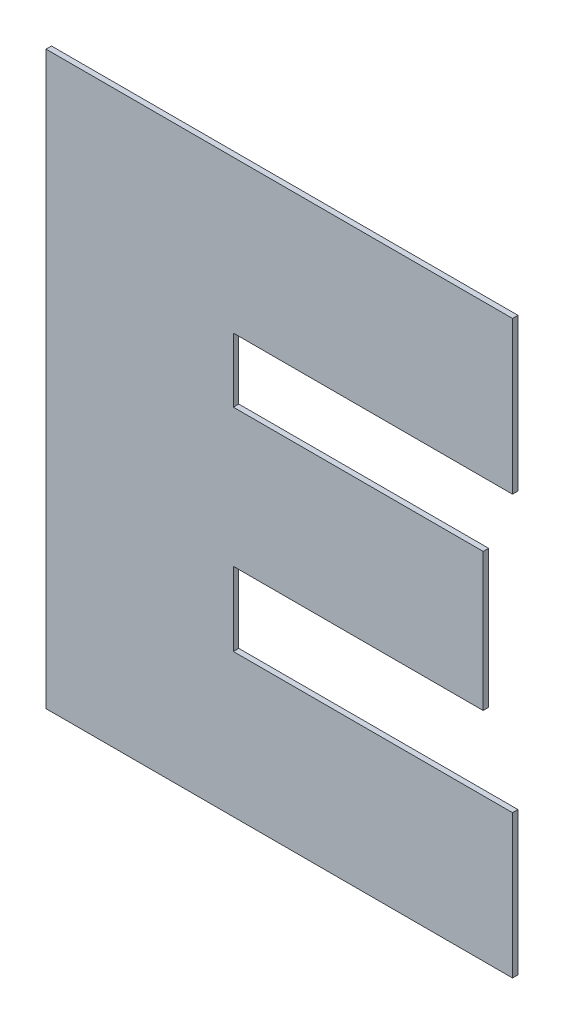
ISO-10303-21;
HEADER;
FILE_DESCRIPTION(('STEP AP214'),'2;1');
FILE_NAME('part.step','',(''),(''),'','','');
FILE_SCHEMA(('AUTOMOTIVE_DESIGN { 1 0 10303 214 1 1 1 1 }'));
ENDSEC;
DATA;
#1=APPLICATION_CONTEXT('core data for automotive mechanical design processes');
#2=APPLICATION_PROTOCOL_DEFINITION('international standard','automotive_design',2000,#1);
#3=PRODUCT_CONTEXT('',#1,'mechanical');
#4=PRODUCT('Part','Part','',(#3));
#5=PRODUCT_RELATED_PRODUCT_CATEGORY('part','',(#4));
#6=PRODUCT_DEFINITION_FORMATION('','',#4);
#7=PRODUCT_DEFINITION_CONTEXT('part definition',#1,'design');
#8=PRODUCT_DEFINITION('design','',#6,#7);
#9=PRODUCT_DEFINITION_SHAPE('','',#8);
#10=(LENGTH_UNIT() NAMED_UNIT(*) SI_UNIT(.MILLI.,.METRE.));
#11=(NAMED_UNIT(*) PLANE_ANGLE_UNIT() SI_UNIT($,.RADIAN.));
#12=(NAMED_UNIT(*) SI_UNIT($,.STERADIAN.) SOLID_ANGLE_UNIT());
#13=UNCERTAINTY_MEASURE_WITH_UNIT(LENGTH_MEASURE(1.E-05),#10,'distance_accuracy_value','');
#14=(GEOMETRIC_REPRESENTATION_CONTEXT(3) GLOBAL_UNCERTAINTY_ASSIGNED_CONTEXT((#13)) GLOBAL_UNIT_ASSIGNED_CONTEXT((#10,
#11,#12)) REPRESENTATION_CONTEXT('',''));
#15=CARTESIAN_POINT('',(0.,0.,0.));
#16=DIRECTION('',(0.,0.,1.));
#17=DIRECTION('',(1.,0.,0.));
#18=AXIS2_PLACEMENT_3D('',#15,#16,#17);
#19=CARTESIAN_POINT('',(0.,1.11494944132031,0.551));
#20=DIRECTION('',(0.,1.,0.));
#21=DIRECTION('',(0.,0.,1.));
#22=AXIS2_PLACEMENT_3D('',#19,#20,#21);
#23=PLANE('',#22);
#24=DIRECTION('',(1.,0.,0.));
#25=VECTOR('',#24,1.);
#26=CARTESIAN_POINT('',(1.26536255211483,1.11494944132031,0.55));
#27=LINE('',#26,#25);
#28=CARTESIAN_POINT('',(1.26536255211483,1.11494944132031,0.55));
#29=VERTEX_POINT('',#28);
#30=CARTESIAN_POINT('',(1.31671644638677,1.11494944132031,0.55));
#31=VERTEX_POINT('',#30);
#32=EDGE_CURVE('E11',#29,#31,#27,.T.);
#33=ORIENTED_EDGE('',*,*,#32,.T.);
#34=DIRECTION('',(0.,-2.22044604925006E-13,-1.));
#35=VECTOR('',#34,1.);
#36=CARTESIAN_POINT('',(1.31671644638677,1.11494944132031,0.551));
#37=LINE('',#36,#35);
#38=CARTESIAN_POINT('',(1.31671644638677,1.11494944132031,0.551));
#39=VERTEX_POINT('',#38);
#40=EDGE_CURVE('E200',#39,#31,#37,.T.);
#41=ORIENTED_EDGE('',*,*,#40,.F.);
#42=DIRECTION('',(1.,0.,0.));
#43=VECTOR('',#42,1.);
#44=CARTESIAN_POINT('',(1.26536255211483,1.11494944132031,0.551));
#45=LINE('',#44,#43);
#46=CARTESIAN_POINT('',(1.26536255211483,1.11494944132031,0.551));
#47=VERTEX_POINT('',#46);
#48=EDGE_CURVE('E194',#47,#39,#45,.T.);
#49=ORIENTED_EDGE('',*,*,#48,.F.);
#50=DIRECTION('',(0.,-2.22044604925006E-13,-1.));
#51=VECTOR('',#50,1.);
#52=CARTESIAN_POINT('',(1.26536255211483,1.11494944132031,0.551));
#53=LINE('',#52,#51);
#54=EDGE_CURVE('E121',#47,#29,#53,.T.);
#55=ORIENTED_EDGE('',*,*,#54,.T.);
#56=EDGE_LOOP('',(#33,#41,#49,#55));
#57=FACE_BOUND('',#56,.T.);
#58=ADVANCED_FACE('F17',(#57),#23,.F.);
#59=CARTESIAN_POINT('',(1.31671644638677,0.,0.551));
#60=DIRECTION('',(-1.,0.,0.));
#61=DIRECTION('',(0.,0.,1.));
#62=AXIS2_PLACEMENT_3D('',#59,#60,#61);
#63=PLANE('',#62);
#64=DIRECTION('',(0.,1.,0.));
#65=VECTOR('',#64,1.);
#66=CARTESIAN_POINT('',(1.31671644638677,1.11494944132031,0.55));
#67=LINE('',#66,#65);
#68=CARTESIAN_POINT('',(1.31671644638677,1.14295195682548,0.55));
#69=VERTEX_POINT('',#68);
#70=EDGE_CURVE('E24',#31,#69,#67,.T.);
#71=ORIENTED_EDGE('',*,*,#70,.T.);
#72=DIRECTION('',(0.,0.,-1.));
#73=VECTOR('',#72,1.);
#74=CARTESIAN_POINT('',(1.31671644638677,1.14295195682548,0.551));
#75=LINE('',#74,#73);
#76=CARTESIAN_POINT('',(1.31671644638677,1.14295195682548,0.551));
#77=VERTEX_POINT('',#76);
#78=EDGE_CURVE('E196',#77,#69,#75,.T.);
#79=ORIENTED_EDGE('',*,*,#78,.F.);
#80=DIRECTION('',(0.,1.,0.));
#81=VECTOR('',#80,1.);
#82=CARTESIAN_POINT('',(1.31671644638677,1.11494944132031,0.551));
#83=LINE('',#82,#81);
#84=EDGE_CURVE('E186',#39,#77,#83,.T.);
#85=ORIENTED_EDGE('',*,*,#84,.F.);
#86=ORIENTED_EDGE('',*,*,#40,.T.);
#87=EDGE_LOOP('',(#71,#79,#85,#86));
#88=FACE_BOUND('',#87,.T.);
#89=ADVANCED_FACE('F202',(#88),#63,.F.);
#90=CARTESIAN_POINT('',(0.,1.14295195682548,0.551));
#91=DIRECTION('',(0.,-1.,0.));
#92=DIRECTION('',(0.,0.,-1.));
#93=AXIS2_PLACEMENT_3D('',#90,#91,#92);
#94=PLANE('',#93);
#95=DIRECTION('',(-1.,0.,0.));
#96=VECTOR('',#95,1.);
#97=CARTESIAN_POINT('',(1.31671644638677,1.14295195682548,0.55));
#98=LINE('',#97,#96);
#99=CARTESIAN_POINT('',(1.23092017763378,1.14295195682548,0.55));
#100=VERTEX_POINT('',#99);
#101=EDGE_CURVE('E198',#69,#100,#98,.T.);
#102=ORIENTED_EDGE('',*,*,#101,.T.);
#103=DIRECTION('',(0.,0.,-1.));
#104=VECTOR('',#103,1.);
#105=CARTESIAN_POINT('',(1.23092017763378,1.14295195682548,0.551));
#106=LINE('',#105,#104);
#107=CARTESIAN_POINT('',(1.23092017763378,1.14295195682548,0.551));
#108=VERTEX_POINT('',#107);
#109=EDGE_CURVE('E189',#108,#100,#106,.T.);
#110=ORIENTED_EDGE('',*,*,#109,.F.);
#111=DIRECTION('',(-1.,0.,0.));
#112=VECTOR('',#111,1.);
#113=CARTESIAN_POINT('',(1.31671644638677,1.14295195682548,0.551));
#114=LINE('',#113,#112);
#115=EDGE_CURVE('E177',#77,#108,#114,.T.);
#116=ORIENTED_EDGE('',*,*,#115,.F.);
#117=ORIENTED_EDGE('',*,*,#78,.T.);
#118=EDGE_LOOP('',(#102,#110,#116,#117));
#119=FACE_BOUND('',#118,.T.);
#120=ADVANCED_FACE('F209',(#119),#94,.F.);
#121=CARTESIAN_POINT('',(1.23092017763378,0.,0.551));
#122=DIRECTION('',(1.,0.,0.));
#123=DIRECTION('',(0.,0.,-1.));
#124=AXIS2_PLACEMENT_3D('',#121,#122,#123);
#125=PLANE('',#124);
#126=DIRECTION('',(0.,-1.,0.));
#127=VECTOR('',#126,1.);
#128=CARTESIAN_POINT('',(1.23092017763378,1.14295195682548,0.55));
#129=LINE('',#128,#127);
#130=CARTESIAN_POINT('',(1.23092017763378,1.03788478321106,0.55));
#131=VERTEX_POINT('',#130);
#132=EDGE_CURVE('E192',#100,#131,#129,.T.);
#133=ORIENTED_EDGE('',*,*,#132,.T.);
#134=DIRECTION('',(0.,0.,-1.));
#135=VECTOR('',#134,1.);
#136=CARTESIAN_POINT('',(1.23092017763378,1.03788478321106,0.551));
#137=LINE('',#136,#135);
#138=CARTESIAN_POINT('',(1.23092017763378,1.03788478321106,0.551));
#139=VERTEX_POINT('',#138);
#140=EDGE_CURVE('E180',#139,#131,#137,.T.);
#141=ORIENTED_EDGE('',*,*,#140,.F.);
#142=DIRECTION('',(0.,-1.,0.));
#143=VECTOR('',#142,1.);
#144=CARTESIAN_POINT('',(1.23092017763378,1.14295195682548,0.551));
#145=LINE('',#144,#143);
#146=EDGE_CURVE('E169',#108,#139,#145,.T.);
#147=ORIENTED_EDGE('',*,*,#146,.F.);
#148=ORIENTED_EDGE('',*,*,#109,.T.);
#149=EDGE_LOOP('',(#133,#141,#147,#148));
#150=FACE_BOUND('',#149,.T.);
#151=ADVANCED_FACE('F213',(#150),#125,.F.);
#152=CARTESIAN_POINT('',(0.,1.03788478321106,0.551));
#153=DIRECTION('',(0.,1.,0.));
#154=DIRECTION('',(0.,0.,1.));
#155=AXIS2_PLACEMENT_3D('',#152,#153,#154);
#156=PLANE('',#155);
#157=DIRECTION('',(1.,0.,0.));
#158=VECTOR('',#157,1.);
#159=CARTESIAN_POINT('',(1.23092017763378,1.03788478321106,0.55));
#160=LINE('',#159,#158);
#161=CARTESIAN_POINT('',(1.31671644638677,1.03788478321106,0.55));
#162=VERTEX_POINT('',#161);
#163=EDGE_CURVE('E183',#131,#162,#160,.T.);
#164=ORIENTED_EDGE('',*,*,#163,.T.);
#165=DIRECTION('',(0.,0.,-1.));
#166=VECTOR('',#165,1.);
#167=CARTESIAN_POINT('',(1.31671644638677,1.03788478321106,0.551));
#168=LINE('',#167,#166);
#169=CARTESIAN_POINT('',(1.31671644638677,1.03788478321106,0.551));
#170=VERTEX_POINT('',#169);
#171=EDGE_CURVE('E172',#170,#162,#168,.T.);
#172=ORIENTED_EDGE('',*,*,#171,.F.);
#173=DIRECTION('',(1.,0.,0.));
#174=VECTOR('',#173,1.);
#175=CARTESIAN_POINT('',(1.23092017763378,1.03788478321106,0.551));
#176=LINE('',#175,#174);
#177=EDGE_CURVE('E161',#139,#170,#176,.T.);
#178=ORIENTED_EDGE('',*,*,#177,.F.);
#179=ORIENTED_EDGE('',*,*,#140,.T.);
#180=EDGE_LOOP('',(#164,#172,#178,#179));
#181=FACE_BOUND('',#180,.T.);
#182=ADVANCED_FACE('F235',(#181),#156,.F.);
#183=CARTESIAN_POINT('',(1.31671644638677,0.,0.551));
#184=DIRECTION('',(-1.,0.,0.));
#185=DIRECTION('',(0.,0.,1.));
#186=AXIS2_PLACEMENT_3D('',#183,#184,#185);
#187=PLANE('',#186);
#188=DIRECTION('',(0.,1.,0.));
#189=VECTOR('',#188,1.);
#190=CARTESIAN_POINT('',(1.31671644638677,1.03788478321106,0.55));
#191=LINE('',#190,#189);
#192=CARTESIAN_POINT('',(1.31671644638677,1.06422085452814,0.55));
#193=VERTEX_POINT('',#192);
#194=EDGE_CURVE('E175',#162,#193,#191,.T.);
#195=ORIENTED_EDGE('',*,*,#194,.T.);
#196=DIRECTION('',(0.,0.,-1.));
#197=VECTOR('',#196,1.);
#198=CARTESIAN_POINT('',(1.31671644638677,1.06422085452814,0.551));
#199=LINE('',#198,#197);
#200=CARTESIAN_POINT('',(1.31671644638677,1.06422085452814,0.551));
#201=VERTEX_POINT('',#200);
#202=EDGE_CURVE('E164',#201,#193,#199,.T.);
#203=ORIENTED_EDGE('',*,*,#202,.F.);
#204=DIRECTION('',(0.,1.,0.));
#205=VECTOR('',#204,1.);
#206=CARTESIAN_POINT('',(1.31671644638677,1.03788478321106,0.551));
#207=LINE('',#206,#205);
#208=EDGE_CURVE('E153',#170,#201,#207,.T.);
#209=ORIENTED_EDGE('',*,*,#208,.F.);
#210=ORIENTED_EDGE('',*,*,#171,.T.);
#211=EDGE_LOOP('',(#195,#203,#209,#210));
#212=FACE_BOUND('',#211,.T.);
#213=ADVANCED_FACE('F233',(#212),#187,.F.);
#214=CARTESIAN_POINT('',(0.,1.06422085452814,0.551));
#215=DIRECTION('',(0.,-1.,0.));
#216=DIRECTION('',(0.,0.,-1.));
#217=AXIS2_PLACEMENT_3D('',#214,#215,#216);
#218=PLANE('',#217);
#219=DIRECTION('',(-1.,0.,0.));
#220=VECTOR('',#219,1.);
#221=CARTESIAN_POINT('',(1.31671644638677,1.06422085452814,0.55));
#222=LINE('',#221,#220);
#223=CARTESIAN_POINT('',(1.26536255211483,1.06422085452814,0.55));
#224=VERTEX_POINT('',#223);
#225=EDGE_CURVE('E167',#193,#224,#222,.T.);
#226=ORIENTED_EDGE('',*,*,#225,.T.);
#227=DIRECTION('',(0.,0.,-1.));
#228=VECTOR('',#227,1.);
#229=CARTESIAN_POINT('',(1.26536255211483,1.06422085452814,0.551));
#230=LINE('',#229,#228);
#231=CARTESIAN_POINT('',(1.26536255211483,1.06422085452814,0.551));
#232=VERTEX_POINT('',#231);
#233=EDGE_CURVE('E156',#232,#224,#230,.T.);
#234=ORIENTED_EDGE('',*,*,#233,.F.);
#235=DIRECTION('',(-1.,0.,0.));
#236=VECTOR('',#235,1.);
#237=CARTESIAN_POINT('',(1.31671644638677,1.06422085452814,0.551));
#238=LINE('',#237,#236);
#239=EDGE_CURVE('E145',#201,#232,#238,.T.);
#240=ORIENTED_EDGE('',*,*,#239,.F.);
#241=ORIENTED_EDGE('',*,*,#202,.T.);
#242=EDGE_LOOP('',(#226,#234,#240,#241));
#243=FACE_BOUND('',#242,.T.);
#244=ADVANCED_FACE('F229',(#243),#218,.F.);
#245=CARTESIAN_POINT('',(1.26536255211483,0.,0.551));
#246=DIRECTION('',(-1.,0.,0.));
#247=DIRECTION('',(0.,0.,1.));
#248=AXIS2_PLACEMENT_3D('',#245,#246,#247);
#249=PLANE('',#248);
#250=DIRECTION('',(0.,1.,0.));
#251=VECTOR('',#250,1.);
#252=CARTESIAN_POINT('',(1.26536255211483,1.06422085452814,0.55));
#253=LINE('',#252,#251);
#254=CARTESIAN_POINT('',(1.26536255211483,1.07779639115823,0.55));
#255=VERTEX_POINT('',#254);
#256=EDGE_CURVE('E159',#224,#255,#253,.T.);
#257=ORIENTED_EDGE('',*,*,#256,.T.);
#258=DIRECTION('',(0.,0.,-1.));
#259=VECTOR('',#258,1.);
#260=CARTESIAN_POINT('',(1.26536255211483,1.07779639115823,0.551));
#261=LINE('',#260,#259);
#262=CARTESIAN_POINT('',(1.26536255211483,1.07779639115823,0.551));
#263=VERTEX_POINT('',#262);
#264=EDGE_CURVE('E148',#263,#255,#261,.T.);
#265=ORIENTED_EDGE('',*,*,#264,.F.);
#266=DIRECTION('',(0.,1.,0.));
#267=VECTOR('',#266,1.);
#268=CARTESIAN_POINT('',(1.26536255211483,1.06422085452814,0.551));
#269=LINE('',#268,#267);
#270=EDGE_CURVE('E137',#232,#263,#269,.T.);
#271=ORIENTED_EDGE('',*,*,#270,.F.);
#272=ORIENTED_EDGE('',*,*,#233,.T.);
#273=EDGE_LOOP('',(#257,#265,#271,#272));
#274=FACE_BOUND('',#273,.T.);
#275=ADVANCED_FACE('F225',(#274),#249,.F.);
#276=CARTESIAN_POINT('',(0.,1.07779639115823,0.551));
#277=DIRECTION('',(0.,1.,0.));
#278=DIRECTION('',(0.,0.,1.));
#279=AXIS2_PLACEMENT_3D('',#276,#277,#278);
#280=PLANE('',#279);
#281=DIRECTION('',(1.,0.,0.));
#282=VECTOR('',#281,1.);
#283=CARTESIAN_POINT('',(1.26536255211483,1.07779639115823,0.55));
#284=LINE('',#283,#282);
#285=CARTESIAN_POINT('',(1.31131976972094,1.07779639115823,0.55));
#286=VERTEX_POINT('',#285);
#287=EDGE_CURVE('E151',#255,#286,#284,.T.);
#288=ORIENTED_EDGE('',*,*,#287,.T.);
#289=DIRECTION('',(0.,0.,-1.));
#290=VECTOR('',#289,1.);
#291=CARTESIAN_POINT('',(1.31131976972094,1.07779639115823,0.551));
#292=LINE('',#291,#290);
#293=CARTESIAN_POINT('',(1.31131976972094,1.07779639115823,0.551));
#294=VERTEX_POINT('',#293);
#295=EDGE_CURVE('E140',#294,#286,#292,.T.);
#296=ORIENTED_EDGE('',*,*,#295,.F.);
#297=DIRECTION('',(1.,0.,0.));
#298=VECTOR('',#297,1.);
#299=CARTESIAN_POINT('',(1.26536255211483,1.07779639115823,0.551));
#300=LINE('',#299,#298);
#301=EDGE_CURVE('E132',#263,#294,#300,.T.);
#302=ORIENTED_EDGE('',*,*,#301,.F.);
#303=ORIENTED_EDGE('',*,*,#264,.T.);
#304=EDGE_LOOP('',(#288,#296,#302,#303));
#305=FACE_BOUND('',#304,.T.);
#306=ADVANCED_FACE('F222',(#305),#280,.F.);
#307=CARTESIAN_POINT('',(1.31131976972094,0.,0.551));
#308=DIRECTION('',(-1.,0.,0.));
#309=DIRECTION('',(0.,0.,1.));
#310=AXIS2_PLACEMENT_3D('',#307,#308,#309);
#311=PLANE('',#310);
#312=DIRECTION('',(0.,1.,0.));
#313=VECTOR('',#312,1.);
#314=CARTESIAN_POINT('',(1.31131976972094,1.07779639115823,0.55));
#315=LINE('',#314,#313);
#316=CARTESIAN_POINT('',(1.31131976972094,1.10314159654861,0.55));
#317=VERTEX_POINT('',#316);
#318=EDGE_CURVE('E143',#286,#317,#315,.T.);
#319=ORIENTED_EDGE('',*,*,#318,.T.);
#320=DIRECTION('',(0.,0.,-1.));
#321=VECTOR('',#320,1.);
#322=CARTESIAN_POINT('',(1.31131976972094,1.10314159654861,0.551));
#323=LINE('',#322,#321);
#324=CARTESIAN_POINT('',(1.31131976972094,1.10314159654861,0.551));
#325=VERTEX_POINT('',#324);
#326=EDGE_CURVE('E134',#325,#317,#323,.T.);
#327=ORIENTED_EDGE('',*,*,#326,.F.);
#328=DIRECTION('',(0.,1.,0.));
#329=VECTOR('',#328,1.);
#330=CARTESIAN_POINT('',(1.31131976972094,1.07779639115823,0.551));
#331=LINE('',#330,#329);
#332=EDGE_CURVE('E115',#294,#325,#331,.T.);
#333=ORIENTED_EDGE('',*,*,#332,.F.);
#334=ORIENTED_EDGE('',*,*,#295,.T.);
#335=EDGE_LOOP('',(#319,#327,#333,#334));
#336=FACE_BOUND('',#335,.T.);
#337=ADVANCED_FACE('F219',(#336),#311,.F.);
#338=CARTESIAN_POINT('',(0.,1.10314159654861,0.551));
#339=DIRECTION('',(0.,-1.,0.));
#340=DIRECTION('',(0.,0.,-1.));
#341=AXIS2_PLACEMENT_3D('',#338,#339,#340);
#342=PLANE('',#341);
#343=DIRECTION('',(-1.,0.,0.));
#344=VECTOR('',#343,1.);
#345=CARTESIAN_POINT('',(1.31131976972094,1.10314159654861,0.55));
#346=LINE('',#345,#344);
#347=CARTESIAN_POINT('',(1.26536255211483,1.10314159654861,0.55));
#348=VERTEX_POINT('',#347);
#349=EDGE_CURVE('E110',#317,#348,#346,.T.);
#350=ORIENTED_EDGE('',*,*,#349,.T.);
#351=DIRECTION('',(0.,0.,-1.));
#352=VECTOR('',#351,1.);
#353=CARTESIAN_POINT('',(1.26536255211483,1.10314159654861,0.551));
#354=LINE('',#353,#352);
#355=CARTESIAN_POINT('',(1.26536255211483,1.10314159654861,0.551));
#356=VERTEX_POINT('',#355);
#357=EDGE_CURVE('E102',#356,#348,#354,.T.);
#358=ORIENTED_EDGE('',*,*,#357,.F.);
#359=DIRECTION('',(-1.,0.,0.));
#360=VECTOR('',#359,1.);
#361=CARTESIAN_POINT('',(1.31131976972094,1.10314159654861,0.551));
#362=LINE('',#361,#360);
#363=EDGE_CURVE('E107',#325,#356,#362,.T.);
#364=ORIENTED_EDGE('',*,*,#363,.F.);
#365=ORIENTED_EDGE('',*,*,#326,.T.);
#366=EDGE_LOOP('',(#350,#358,#364,#365));
#367=FACE_BOUND('',#366,.T.);
#368=ADVANCED_FACE('F104',(#367),#342,.F.);
#369=CARTESIAN_POINT('',(1.26536255211483,0.,0.551));
#370=DIRECTION('',(-1.,0.,0.));
#371=DIRECTION('',(0.,0.,1.));
#372=AXIS2_PLACEMENT_3D('',#369,#370,#371);
#373=PLANE('',#372);
#374=DIRECTION('',(0.,1.,0.));
#375=VECTOR('',#374,1.);
#376=CARTESIAN_POINT('',(1.26536255211483,1.10314159654861,0.55));
#377=LINE('',#376,#375);
#378=EDGE_CURVE('E114',#348,#29,#377,.T.);
#379=ORIENTED_EDGE('',*,*,#378,.T.);
#380=ORIENTED_EDGE('',*,*,#54,.F.);
#381=DIRECTION('',(0.,1.,0.));
#382=VECTOR('',#381,1.);
#383=CARTESIAN_POINT('',(1.26536255211483,1.10314159654861,0.551));
#384=LINE('',#383,#382);
#385=EDGE_CURVE('E119',#356,#47,#384,.T.);
#386=ORIENTED_EDGE('',*,*,#385,.F.);
#387=ORIENTED_EDGE('',*,*,#357,.T.);
#388=EDGE_LOOP('',(#379,#380,#386,#387));
#389=FACE_BOUND('',#388,.T.);
#390=ADVANCED_FACE('F120',(#389),#373,.F.);
#391=CARTESIAN_POINT('',(0.,0.,0.551));
#392=DIRECTION('',(0.,0.,1.));
#393=DIRECTION('',(1.,0.,0.));
#394=AXIS2_PLACEMENT_3D('',#391,#392,#393);
#395=PLANE('',#394);
#396=ORIENTED_EDGE('',*,*,#48,.T.);
#397=ORIENTED_EDGE('',*,*,#84,.T.);
#398=ORIENTED_EDGE('',*,*,#115,.T.);
#399=ORIENTED_EDGE('',*,*,#146,.T.);
#400=ORIENTED_EDGE('',*,*,#177,.T.);
#401=ORIENTED_EDGE('',*,*,#208,.T.);
#402=ORIENTED_EDGE('',*,*,#239,.T.);
#403=ORIENTED_EDGE('',*,*,#270,.T.);
#404=ORIENTED_EDGE('',*,*,#301,.T.);
#405=ORIENTED_EDGE('',*,*,#332,.T.);
#406=ORIENTED_EDGE('',*,*,#363,.T.);
#407=ORIENTED_EDGE('',*,*,#385,.T.);
#408=EDGE_LOOP('',(#396,#397,#398,#399,#400,#401,#402,#403,#404,#405,#406,#407));
#409=FACE_BOUND('',#408,.T.);
#410=ADVANCED_FACE('F125',(#409),#395,.T.);
#411=CARTESIAN_POINT('',(0.,0.,0.55));
#412=DIRECTION('',(0.,0.,1.));
#413=DIRECTION('',(1.,0.,0.));
#414=AXIS2_PLACEMENT_3D('',#411,#412,#413);
#415=PLANE('',#414);
#416=ORIENTED_EDGE('',*,*,#32,.F.);
#417=ORIENTED_EDGE('',*,*,#378,.F.);
#418=ORIENTED_EDGE('',*,*,#349,.F.);
#419=ORIENTED_EDGE('',*,*,#318,.F.);
#420=ORIENTED_EDGE('',*,*,#287,.F.);
#421=ORIENTED_EDGE('',*,*,#256,.F.);
#422=ORIENTED_EDGE('',*,*,#225,.F.);
#423=ORIENTED_EDGE('',*,*,#194,.F.);
#424=ORIENTED_EDGE('',*,*,#163,.F.);
#425=ORIENTED_EDGE('',*,*,#132,.F.);
#426=ORIENTED_EDGE('',*,*,#101,.F.);
#427=ORIENTED_EDGE('',*,*,#70,.F.);
#428=EDGE_LOOP('',(#416,#417,#418,#419,#420,#421,#422,#423,#424,#425,#426,#427));
#429=FACE_BOUND('',#428,.T.);
#430=ADVANCED_FACE('F205',(#429),#415,.F.);
#431=CLOSED_SHELL('',(#58,#89,#120,#151,#182,#213,#244,#275,#306,#337,#368,#390,#410,#430));
#432=MANIFOLD_SOLID_BREP('B1',#431);
#433=ADVANCED_BREP_SHAPE_REPRESENTATION('',(#18,#432),#14);
#434=SHAPE_DEFINITION_REPRESENTATION(#9,#433);
ENDSEC;
END-ISO-10303-21;
